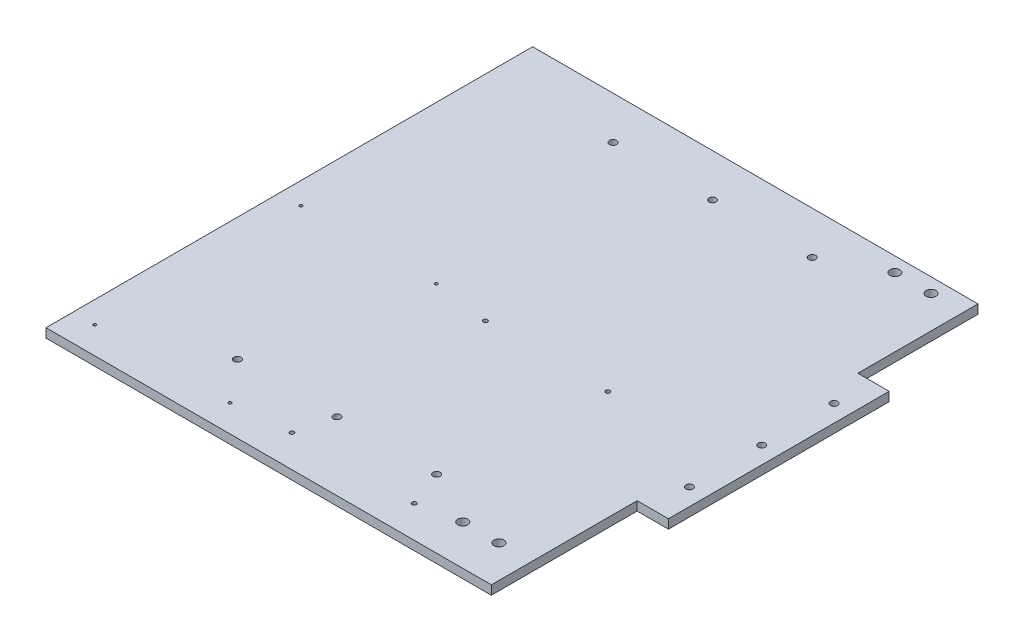
ISO-10303-21;
HEADER;
FILE_DESCRIPTION(('STEP AP214'),'2;1');
FILE_NAME('part.step','',(''),(''),'','','');
FILE_SCHEMA(('AUTOMOTIVE_DESIGN { 1 0 10303 214 1 1 1 1 }'));
ENDSEC;
DATA;
#1=APPLICATION_CONTEXT('core data for automotive mechanical design processes');
#2=APPLICATION_PROTOCOL_DEFINITION('international standard','automotive_design',2000,#1);
#3=PRODUCT_CONTEXT('',#1,'mechanical');
#4=PRODUCT('Part','Part','',(#3));
#5=PRODUCT_RELATED_PRODUCT_CATEGORY('part','',(#4));
#6=PRODUCT_DEFINITION_FORMATION('','',#4);
#7=PRODUCT_DEFINITION_CONTEXT('part definition',#1,'design');
#8=PRODUCT_DEFINITION('design','',#6,#7);
#9=PRODUCT_DEFINITION_SHAPE('','',#8);
#10=(LENGTH_UNIT() NAMED_UNIT(*) SI_UNIT(.MILLI.,.METRE.));
#11=(NAMED_UNIT(*) PLANE_ANGLE_UNIT() SI_UNIT($,.RADIAN.));
#12=(NAMED_UNIT(*) SI_UNIT($,.STERADIAN.) SOLID_ANGLE_UNIT());
#13=UNCERTAINTY_MEASURE_WITH_UNIT(LENGTH_MEASURE(1.E-05),#10,'distance_accuracy_value','');
#14=(GEOMETRIC_REPRESENTATION_CONTEXT(3) GLOBAL_UNCERTAINTY_ASSIGNED_CONTEXT((#13)) GLOBAL_UNIT_ASSIGNED_CONTEXT((#10,
#11,#12)) REPRESENTATION_CONTEXT('',''));
#15=CARTESIAN_POINT('',(0.,0.,0.));
#16=DIRECTION('',(0.,0.,1.));
#17=DIRECTION('',(1.,0.,0.));
#18=AXIS2_PLACEMENT_3D('',#15,#16,#17);
#19=CARTESIAN_POINT('',(156.499999999998,-6.35,171.));
#20=DIRECTION('',(1.,0.,0.));
#21=DIRECTION('',(0.,0.,-1.));
#22=AXIS2_PLACEMENT_3D('',#19,#20,#21);
#23=PLANE('',#22);
#24=DIRECTION('',(0.,0.,-1.));
#25=VECTOR('',#24,1.);
#26=CARTESIAN_POINT('',(156.499999999998,-6.35,171.));
#27=LINE('',#26,#25);
#28=CARTESIAN_POINT('',(156.499999999998,-6.35,171.));
#29=VERTEX_POINT('',#28);
#30=CARTESIAN_POINT('',(156.499999999998,-6.35,68.570201764885));
#31=VERTEX_POINT('',#30);
#32=EDGE_CURVE('E147',#29,#31,#27,.T.);
#33=ORIENTED_EDGE('',*,*,#32,.T.);
#34=DIRECTION('',(0.,1.,0.));
#35=VECTOR('',#34,1.);
#36=CARTESIAN_POINT('',(156.499999999998,-6.35,68.570201764885));
#37=LINE('',#36,#35);
#38=CARTESIAN_POINT('',(156.499999999998,0.,68.570201764885));
#39=VERTEX_POINT('',#38);
#40=EDGE_CURVE('E129',#31,#39,#37,.T.);
#41=ORIENTED_EDGE('',*,*,#40,.T.);
#42=DIRECTION('',(0.,0.,-1.));
#43=VECTOR('',#42,1.);
#44=CARTESIAN_POINT('',(156.499999999998,0.,171.));
#45=LINE('',#44,#43);
#46=CARTESIAN_POINT('',(156.499999999998,0.,171.));
#47=VERTEX_POINT('',#46);
#48=EDGE_CURVE('E157',#47,#39,#45,.T.);
#49=ORIENTED_EDGE('',*,*,#48,.F.);
#50=DIRECTION('',(0.,1.,0.));
#51=VECTOR('',#50,1.);
#52=CARTESIAN_POINT('',(156.499999999998,-6.35,171.));
#53=LINE('',#52,#51);
#54=EDGE_CURVE('E11',#29,#47,#53,.T.);
#55=ORIENTED_EDGE('',*,*,#54,.F.);
#56=EDGE_LOOP('',(#33,#41,#49,#55));
#57=FACE_BOUND('',#56,.T.);
#58=ADVANCED_FACE('F36',(#57),#23,.T.);
#59=DIRECTION('',(0.,1.,0.));
#60=VECTOR('',#59,1.);
#61=CARTESIAN_POINT('',(156.499999999998,-6.35,-86.570201764878));
#62=LINE('',#61,#60);
#63=CARTESIAN_POINT('',(156.499999999998,-6.35,-86.570201764878));
#64=VERTEX_POINT('',#63);
#65=CARTESIAN_POINT('',(156.499999999998,0.,-86.570201764878));
#66=VERTEX_POINT('',#65);
#67=EDGE_CURVE('E144',#64,#66,#62,.T.);
#68=ORIENTED_EDGE('',*,*,#67,.F.);
#69=CARTESIAN_POINT('',(156.499999999998,-6.35,-171.));
#70=VERTEX_POINT('',#69);
#71=EDGE_CURVE('E87',#64,#70,#27,.T.);
#72=ORIENTED_EDGE('',*,*,#71,.T.);
#73=DIRECTION('',(0.,1.,0.));
#74=VECTOR('',#73,1.);
#75=CARTESIAN_POINT('',(156.499999999998,-6.35,-171.));
#76=LINE('',#75,#74);
#77=CARTESIAN_POINT('',(156.499999999998,0.,-171.));
#78=VERTEX_POINT('',#77);
#79=EDGE_CURVE('E40',#70,#78,#76,.T.);
#80=ORIENTED_EDGE('',*,*,#79,.T.);
#81=EDGE_CURVE('E143',#66,#78,#45,.T.);
#82=ORIENTED_EDGE('',*,*,#81,.F.);
#83=EDGE_LOOP('',(#68,#72,#80,#82));
#84=FACE_BOUND('',#83,.T.);
#85=ADVANCED_FACE('F38',(#84),#23,.T.);
#86=CARTESIAN_POINT('',(-156.500000000002,-6.35,171.));
#87=DIRECTION('',(0.,0.,1.));
#88=DIRECTION('',(1.,0.,0.));
#89=AXIS2_PLACEMENT_3D('',#86,#87,#88);
#90=PLANE('',#89);
#91=DIRECTION('',(1.,0.,0.));
#92=VECTOR('',#91,1.);
#93=CARTESIAN_POINT('',(-156.500000000002,0.,171.));
#94=LINE('',#93,#92);
#95=CARTESIAN_POINT('',(-156.500000000002,0.,171.));
#96=VERTEX_POINT('',#95);
#97=EDGE_CURVE('E166',#96,#47,#94,.T.);
#98=ORIENTED_EDGE('',*,*,#97,.F.);
#99=DIRECTION('',(0.,1.,0.));
#100=VECTOR('',#99,1.);
#101=CARTESIAN_POINT('',(-156.500000000002,-6.35,171.));
#102=LINE('',#101,#100);
#103=CARTESIAN_POINT('',(-156.500000000002,-6.35,171.));
#104=VERTEX_POINT('',#103);
#105=EDGE_CURVE('E45',#104,#96,#102,.T.);
#106=ORIENTED_EDGE('',*,*,#105,.F.);
#107=DIRECTION('',(1.,0.,0.));
#108=VECTOR('',#107,1.);
#109=CARTESIAN_POINT('',(-156.500000000002,-6.35,171.));
#110=LINE('',#109,#108);
#111=EDGE_CURVE('E155',#104,#29,#110,.T.);
#112=ORIENTED_EDGE('',*,*,#111,.T.);
#113=ORIENTED_EDGE('',*,*,#54,.T.);
#114=EDGE_LOOP('',(#98,#106,#112,#113));
#115=FACE_BOUND('',#114,.T.);
#116=ADVANCED_FACE('F186',(#115),#90,.T.);
#117=CARTESIAN_POINT('',(-156.500000000002,-6.35,171.));
#118=DIRECTION('',(-1.,0.,0.));
#119=DIRECTION('',(0.,0.,1.));
#120=AXIS2_PLACEMENT_3D('',#117,#118,#119);
#121=PLANE('',#120);
#122=DIRECTION('',(0.,0.,1.));
#123=VECTOR('',#122,1.);
#124=CARTESIAN_POINT('',(-156.500000000002,0.,171.));
#125=LINE('',#124,#123);
#126=CARTESIAN_POINT('',(-156.500000000002,0.,-171.));
#127=VERTEX_POINT('',#126);
#128=EDGE_CURVE('E163',#127,#96,#125,.T.);
#129=ORIENTED_EDGE('',*,*,#128,.F.);
#130=DIRECTION('',(0.,1.,0.));
#131=VECTOR('',#130,1.);
#132=CARTESIAN_POINT('',(-156.500000000002,-6.35,-171.));
#133=LINE('',#132,#131);
#134=CARTESIAN_POINT('',(-156.500000000002,-6.35,-171.));
#135=VERTEX_POINT('',#134);
#136=EDGE_CURVE('E169',#135,#127,#133,.T.);
#137=ORIENTED_EDGE('',*,*,#136,.F.);
#138=DIRECTION('',(0.,0.,1.));
#139=VECTOR('',#138,1.);
#140=CARTESIAN_POINT('',(-156.500000000002,-6.35,171.));
#141=LINE('',#140,#139);
#142=EDGE_CURVE('E152',#135,#104,#141,.T.);
#143=ORIENTED_EDGE('',*,*,#142,.T.);
#144=ORIENTED_EDGE('',*,*,#105,.T.);
#145=EDGE_LOOP('',(#129,#137,#143,#144));
#146=FACE_BOUND('',#145,.T.);
#147=ADVANCED_FACE('F185',(#146),#121,.T.);
#148=CARTESIAN_POINT('',(-156.500000000002,-6.35,-171.));
#149=DIRECTION('',(0.,0.,-1.));
#150=DIRECTION('',(-1.,0.,0.));
#151=AXIS2_PLACEMENT_3D('',#148,#149,#150);
#152=PLANE('',#151);
#153=DIRECTION('',(-1.,0.,0.));
#154=VECTOR('',#153,1.);
#155=CARTESIAN_POINT('',(-156.500000000002,0.,-171.));
#156=LINE('',#155,#154);
#157=EDGE_CURVE('E160',#78,#127,#156,.T.);
#158=ORIENTED_EDGE('',*,*,#157,.F.);
#159=ORIENTED_EDGE('',*,*,#79,.F.);
#160=DIRECTION('',(-1.,0.,0.));
#161=VECTOR('',#160,1.);
#162=CARTESIAN_POINT('',(-156.500000000002,-6.35,-171.));
#163=LINE('',#162,#161);
#164=EDGE_CURVE('E149',#70,#135,#163,.T.);
#165=ORIENTED_EDGE('',*,*,#164,.T.);
#166=ORIENTED_EDGE('',*,*,#136,.T.);
#167=EDGE_LOOP('',(#158,#159,#165,#166));
#168=FACE_BOUND('',#167,.T.);
#169=ADVANCED_FACE('F175',(#168),#152,.T.);
#170=CARTESIAN_POINT('',(0.,-6.35,0.));
#171=DIRECTION('',(0.,-1.,0.));
#172=DIRECTION('',(0.,0.,-1.));
#173=AXIS2_PLACEMENT_3D('',#170,#171,#172);
#174=PLANE('',#173);
#175=CARTESIAN_POINT('',(-46.1138576779062,-6.35000000000026,7.1138576779035));
#176=DIRECTION('',(0.,1.,0.));
#177=DIRECTION('',(0.,0.,1.));
#178=AXIS2_PLACEMENT_3D('',#175,#176,#177);
#179=CIRCLE('',#178,1.05000000000002);
#180=CARTESIAN_POINT('',(-46.1138576779062,-6.35000000000026,8.16385767790351));
#181=VERTEX_POINT('',#180);
#182=EDGE_CURVE('E322',#181,#181,#179,.T.);
#183=ORIENTED_EDGE('',*,*,#182,.T.);
#184=EDGE_LOOP('',(#183));
#185=FACE_BOUND('',#184,.T.);
#186=CARTESIAN_POINT('',(79.7700374531822,-6.35000000000026,12.4704119850208));
#187=DIRECTION('',(0.,1.,0.));
#188=DIRECTION('',(0.,0.,1.));
#189=AXIS2_PLACEMENT_3D('',#186,#187,#188);
#190=CIRCLE('',#189,1.50000000000009);
#191=CARTESIAN_POINT('',(79.7700374531822,-6.35000000000026,13.9704119850209));
#192=VERTEX_POINT('',#191);
#193=EDGE_CURVE('E332',#192,#192,#190,.T.);
#194=ORIENTED_EDGE('',*,*,#193,.T.);
#195=EDGE_LOOP('',(#194));
#196=FACE_BOUND('',#195,.T.);
#197=CARTESIAN_POINT('',(-6.2299625468179,-6.35000000000026,12.4704119850202));
#198=DIRECTION('',(0.,1.,0.));
#199=DIRECTION('',(0.,0.,1.));
#200=AXIS2_PLACEMENT_3D('',#197,#198,#199);
#201=CIRCLE('',#200,1.49999999999985);
#202=CARTESIAN_POINT('',(-6.2299625468179,-6.35000000000026,13.9704119850201));
#203=VERTEX_POINT('',#202);
#204=EDGE_CURVE('E331',#203,#203,#201,.T.);
#205=ORIENTED_EDGE('',*,*,#204,.T.);
#206=EDGE_LOOP('',(#205));
#207=FACE_BOUND('',#206,.T.);
#208=CARTESIAN_POINT('',(-6.22996254681885,-6.35000000000026,148.47041198502));
#209=DIRECTION('',(0.,1.,0.));
#210=DIRECTION('',(0.,0.,1.));
#211=AXIS2_PLACEMENT_3D('',#208,#209,#210);
#212=CIRCLE('',#211,1.49999999999985);
#213=CARTESIAN_POINT('',(-6.22996254681885,-6.35000000000026,149.97041198502));
#214=VERTEX_POINT('',#213);
#215=EDGE_CURVE('E343',#214,#214,#212,.T.);
#216=ORIENTED_EDGE('',*,*,#215,.T.);
#217=EDGE_LOOP('',(#216));
#218=FACE_BOUND('',#217,.T.);
#219=CARTESIAN_POINT('',(-141.113857677907,-6.35000000000026,152.113857677903));
#220=DIRECTION('',(0.,1.,0.));
#221=DIRECTION('',(0.,0.,1.));
#222=AXIS2_PLACEMENT_3D('',#219,#220,#221);
#223=CIRCLE('',#222,1.05000000000003);
#224=CARTESIAN_POINT('',(-141.113857677907,-6.35000000000026,153.163857677903));
#225=VERTEX_POINT('',#224);
#226=EDGE_CURVE('E307',#225,#225,#223,.T.);
#227=ORIENTED_EDGE('',*,*,#226,.T.);
#228=EDGE_LOOP('',(#227));
#229=FACE_BOUND('',#228,.T.);
#230=CARTESIAN_POINT('',(-141.113857677906,-6.35000000000026,7.11385767790317));
#231=DIRECTION('',(0.,1.,0.));
#232=DIRECTION('',(0.,0.,1.));
#233=AXIS2_PLACEMENT_3D('',#230,#231,#232);
#234=CIRCLE('',#233,1.05000000000019);
#235=CARTESIAN_POINT('',(-141.113857677906,-6.35000000000026,8.16385767790336));
#236=VERTEX_POINT('',#235);
#237=EDGE_CURVE('E312',#236,#236,#234,.T.);
#238=ORIENTED_EDGE('',*,*,#237,.T.);
#239=EDGE_LOOP('',(#238));
#240=FACE_BOUND('',#239,.T.);
#241=CARTESIAN_POINT('',(-46.1138576779068,-6.35000000000026,152.113857677903));
#242=DIRECTION('',(0.,1.,0.));
#243=DIRECTION('',(0.,0.,1.));
#244=AXIS2_PLACEMENT_3D('',#241,#242,#243);
#245=CIRCLE('',#244,1.04999999999979);
#246=CARTESIAN_POINT('',(-46.1138576779068,-6.35000000000026,153.163857677903));
#247=VERTEX_POINT('',#246);
#248=EDGE_CURVE('E323',#247,#247,#245,.T.);
#249=ORIENTED_EDGE('',*,*,#248,.T.);
#250=EDGE_LOOP('',(#249));
#251=FACE_BOUND('',#250,.T.);
#252=CARTESIAN_POINT('',(79.7700374531812,-6.35000000000026,148.470411985021));
#253=DIRECTION('',(0.,1.,0.));
#254=DIRECTION('',(0.,0.,1.));
#255=AXIS2_PLACEMENT_3D('',#252,#253,#254);
#256=CIRCLE('',#255,1.50000000000009);
#257=CARTESIAN_POINT('',(79.7700374531812,-6.35000000000026,149.970411985021));
#258=VERTEX_POINT('',#257);
#259=EDGE_CURVE('E351',#258,#258,#256,.T.);
#260=ORIENTED_EDGE('',*,*,#259,.T.);
#261=EDGE_LOOP('',(#260));
#262=FACE_BOUND('',#261,.T.);
#263=CARTESIAN_POINT('',(133.639999999999,-6.35000000000039,-160.839999999994));
#264=DIRECTION('',(0.,-1.,0.));
#265=DIRECTION('',(0.,0.,-1.));
#266=AXIS2_PLACEMENT_3D('',#263,#264,#265);
#267=CIRCLE('',#266,3.49999999999999);
#268=CARTESIAN_POINT('',(133.639999999999,-6.35000000000026,-164.339999999994));
#269=VERTEX_POINT('',#268);
#270=EDGE_CURVE('E357',#269,#269,#267,.T.);
#271=ORIENTED_EDGE('',*,*,#270,.F.);
#272=EDGE_LOOP('',(#271));
#273=FACE_BOUND('',#272,.T.);
#274=CARTESIAN_POINT('',(108.239999999999,-6.35000000000039,-160.839999999994));
#275=DIRECTION('',(0.,-1.,0.));
#276=DIRECTION('',(0.,0.,-1.));
#277=AXIS2_PLACEMENT_3D('',#274,#275,#276);
#278=CIRCLE('',#277,3.50000000000001);
#279=CARTESIAN_POINT('',(108.239999999999,-6.35000000000026,-164.339999999994));
#280=VERTEX_POINT('',#279);
#281=EDGE_CURVE('E364',#280,#280,#278,.T.);
#282=ORIENTED_EDGE('',*,*,#281,.F.);
#283=EDGE_LOOP('',(#282));
#284=FACE_BOUND('',#283,.T.);
#285=CARTESIAN_POINT('',(133.639999999998,-6.35,142.84));
#286=DIRECTION('',(0.,1.,0.));
#287=DIRECTION('',(0.,0.,1.));
#288=AXIS2_PLACEMENT_3D('',#285,#286,#287);
#289=CIRCLE('',#288,3.49999999999999);
#290=CARTESIAN_POINT('',(133.639999999998,-6.35,146.34));
#291=VERTEX_POINT('',#290);
#292=EDGE_CURVE('E369',#291,#291,#289,.T.);
#293=ORIENTED_EDGE('',*,*,#292,.T.);
#294=EDGE_LOOP('',(#293));
#295=FACE_BOUND('',#294,.T.);
#296=CARTESIAN_POINT('',(108.239999999998,-6.35,142.84));
#297=DIRECTION('',(0.,1.,0.));
#298=DIRECTION('',(0.,0.,1.));
#299=AXIS2_PLACEMENT_3D('',#296,#297,#298);
#300=CIRCLE('',#299,3.50000000000001);
#301=CARTESIAN_POINT('',(108.239999999998,-6.35,146.34));
#302=VERTEX_POINT('',#301);
#303=EDGE_CURVE('E360',#302,#302,#300,.T.);
#304=ORIENTED_EDGE('',*,*,#303,.T.);
#305=EDGE_LOOP('',(#304));
#306=FACE_BOUND('',#305,.T.);
#307=CARTESIAN_POINT('',(-70.,-6.35,123.000000000004));
#308=DIRECTION('',(0.,1.,0.));
#309=DIRECTION('',(0.,0.,1.));
#310=AXIS2_PLACEMENT_3D('',#307,#308,#309);
#311=CIRCLE('',#310,2.5);
#312=CARTESIAN_POINT('',(-70.,-6.35,125.500000000004));
#313=VERTEX_POINT('',#312);
#314=EDGE_CURVE('E391',#313,#313,#311,.T.);
#315=ORIENTED_EDGE('',*,*,#314,.T.);
#316=EDGE_LOOP('',(#315));
#317=FACE_BOUND('',#316,.T.);
#318=CARTESIAN_POINT('',(70.,-6.35,123.000000000004));
#319=DIRECTION('',(0.,1.,0.));
#320=DIRECTION('',(0.,0.,-1.));
#321=AXIS2_PLACEMENT_3D('',#318,#319,#320);
#322=CIRCLE('',#321,2.5);
#323=CARTESIAN_POINT('',(70.,-6.35,120.500000000004));
#324=VERTEX_POINT('',#323);
#325=EDGE_CURVE('E397',#324,#324,#322,.T.);
#326=ORIENTED_EDGE('',*,*,#325,.T.);
#327=EDGE_LOOP('',(#326));
#328=FACE_BOUND('',#327,.T.);
#329=CARTESIAN_POINT('',(-70.,-6.35,-140.999999999996));
#330=DIRECTION('',(0.,1.,0.));
#331=DIRECTION('',(0.,0.,-1.));
#332=AXIS2_PLACEMENT_3D('',#329,#330,#331);
#333=CIRCLE('',#332,2.5);
#334=CARTESIAN_POINT('',(-70.,-6.35,-143.499999999996));
#335=VERTEX_POINT('',#334);
#336=EDGE_CURVE('E403',#335,#335,#333,.T.);
#337=ORIENTED_EDGE('',*,*,#336,.T.);
#338=EDGE_LOOP('',(#337));
#339=FACE_BOUND('',#338,.T.);
#340=CARTESIAN_POINT('',(0.,-6.35,-140.999999999996));
#341=DIRECTION('',(0.,1.,0.));
#342=DIRECTION('',(0.,0.,-1.));
#343=AXIS2_PLACEMENT_3D('',#340,#341,#342);
#344=CIRCLE('',#343,2.49999999999999);
#345=CARTESIAN_POINT('',(0.,-6.35,-143.499999999996));
#346=VERTEX_POINT('',#345);
#347=EDGE_CURVE('E384',#346,#346,#344,.T.);
#348=ORIENTED_EDGE('',*,*,#347,.T.);
#349=EDGE_LOOP('',(#348));
#350=FACE_BOUND('',#349,.T.);
#351=CARTESIAN_POINT('',(70.,-6.35,-140.999999999996));
#352=DIRECTION('',(0.,1.,0.));
#353=DIRECTION('',(0.,0.,1.));
#354=AXIS2_PLACEMENT_3D('',#351,#352,#353);
#355=CIRCLE('',#354,2.5);
#356=CARTESIAN_POINT('',(70.,-6.35,-138.499999999996));
#357=VERTEX_POINT('',#356);
#358=EDGE_CURVE('E372',#357,#357,#355,.T.);
#359=ORIENTED_EDGE('',*,*,#358,.T.);
#360=EDGE_LOOP('',(#359));
#361=FACE_BOUND('',#360,.T.);
#362=CARTESIAN_POINT('',(0.,-6.35,123.000000000004));
#363=DIRECTION('',(0.,1.,0.));
#364=DIRECTION('',(0.,0.,1.));
#365=AXIS2_PLACEMENT_3D('',#362,#363,#364);
#366=CIRCLE('',#365,2.5);
#367=CARTESIAN_POINT('',(0.,-6.35,125.500000000004));
#368=VERTEX_POINT('',#367);
#369=EDGE_CURVE('E411',#368,#368,#366,.T.);
#370=ORIENTED_EDGE('',*,*,#369,.T.);
#371=EDGE_LOOP('',(#370));
#372=FACE_BOUND('',#371,.T.);
#373=ORIENTED_EDGE('',*,*,#32,.F.);
#374=ORIENTED_EDGE('',*,*,#111,.F.);
#375=ORIENTED_EDGE('',*,*,#142,.F.);
#376=ORIENTED_EDGE('',*,*,#164,.F.);
#377=ORIENTED_EDGE('',*,*,#71,.F.);
#378=DIRECTION('',(-1.,0.,0.));
#379=VECTOR('',#378,1.);
#380=CARTESIAN_POINT('',(178.499999999998,-6.35,-86.570201764878));
#381=LINE('',#380,#379);
#382=CARTESIAN_POINT('',(178.499999999998,-6.35,-86.570201764878));
#383=VERTEX_POINT('',#382);
#384=EDGE_CURVE('E119',#383,#64,#381,.T.);
#385=ORIENTED_EDGE('',*,*,#384,.F.);
#386=DIRECTION('',(0.,0.,-1.));
#387=VECTOR('',#386,1.);
#388=CARTESIAN_POINT('',(178.499999999998,-6.35,68.570201764885));
#389=LINE('',#388,#387);
#390=CARTESIAN_POINT('',(178.499999999998,-6.35,68.570201764885));
#391=VERTEX_POINT('',#390);
#392=EDGE_CURVE('E114',#391,#383,#389,.T.);
#393=ORIENTED_EDGE('',*,*,#392,.F.);
#394=DIRECTION('',(1.,0.,0.));
#395=VECTOR('',#394,1.);
#396=CARTESIAN_POINT('',(156.499999999998,-6.35,68.570201764885));
#397=LINE('',#396,#395);
#398=EDGE_CURVE('E126',#31,#391,#397,.T.);
#399=ORIENTED_EDGE('',*,*,#398,.F.);
#400=EDGE_LOOP('',(#373,#374,#375,#376,#377,#385,#393,#399));
#401=FACE_BOUND('',#400,.T.);
#402=CARTESIAN_POINT('',(166.499999999998,-6.35,-59.7999999999965));
#403=DIRECTION('',(0.,1.,0.));
#404=DIRECTION('',(0.,0.,-1.));
#405=AXIS2_PLACEMENT_3D('',#402,#403,#404);
#406=CIRCLE('',#405,2.5);
#407=CARTESIAN_POINT('',(166.499999999998,-6.35,-62.2999999999965));
#408=VERTEX_POINT('',#407);
#409=EDGE_CURVE('E417',#408,#408,#406,.T.);
#410=ORIENTED_EDGE('',*,*,#409,.T.);
#411=EDGE_LOOP('',(#410));
#412=FACE_BOUND('',#411,.T.);
#413=CARTESIAN_POINT('',(166.499999999998,-6.35,41.8000000000035));
#414=DIRECTION('',(0.,1.,0.));
#415=DIRECTION('',(0.,0.,1.));
#416=AXIS2_PLACEMENT_3D('',#413,#414,#415);
#417=CIRCLE('',#416,2.5);
#418=CARTESIAN_POINT('',(166.499999999998,-6.35,44.3000000000035));
#419=VERTEX_POINT('',#418);
#420=EDGE_CURVE('E423',#419,#419,#417,.T.);
#421=ORIENTED_EDGE('',*,*,#420,.T.);
#422=EDGE_LOOP('',(#421));
#423=FACE_BOUND('',#422,.T.);
#424=CARTESIAN_POINT('',(166.499999999998,-6.35,-8.99999999999648));
#425=DIRECTION('',(0.,1.,0.));
#426=DIRECTION('',(0.,0.,1.));
#427=AXIS2_PLACEMENT_3D('',#424,#425,#426);
#428=CIRCLE('',#427,2.5);
#429=CARTESIAN_POINT('',(166.499999999998,-6.35,-6.49999999999649));
#430=VERTEX_POINT('',#429);
#431=EDGE_CURVE('E140',#430,#430,#428,.T.);
#432=ORIENTED_EDGE('',*,*,#431,.T.);
#433=EDGE_LOOP('',(#432));
#434=FACE_BOUND('',#433,.T.);
#435=ADVANCED_FACE('F124',(#185,#196,#207,#218,#229,#240,#251,#262,#273,#284,#295,#306,#317,
#328,#339,#350,#361,#372,#401,#412,#423,#434),#174,.T.);
#436=CARTESIAN_POINT('',(0.,0.,0.));
#437=DIRECTION('',(0.,-1.,0.));
#438=DIRECTION('',(0.,0.,-1.));
#439=AXIS2_PLACEMENT_3D('',#436,#437,#438);
#440=PLANE('',#439);
#441=CARTESIAN_POINT('',(-46.1138576779062,0.,7.1138576779035));
#442=DIRECTION('',(0.,1.,0.));
#443=DIRECTION('',(0.,0.,1.));
#444=AXIS2_PLACEMENT_3D('',#441,#442,#443);
#445=CIRCLE('',#444,1.05000000000002);
#446=CARTESIAN_POINT('',(-46.1138576779062,0.,8.16385767790351));
#447=VERTEX_POINT('',#446);
#448=EDGE_CURVE('E335',#447,#447,#445,.T.);
#449=ORIENTED_EDGE('',*,*,#448,.F.);
#450=EDGE_LOOP('',(#449));
#451=FACE_BOUND('',#450,.T.);
#452=CARTESIAN_POINT('',(79.7700374531822,0.,12.4704119850208));
#453=DIRECTION('',(0.,1.,0.));
#454=DIRECTION('',(0.,0.,1.));
#455=AXIS2_PLACEMENT_3D('',#452,#453,#454);
#456=CIRCLE('',#455,1.50000000000009);
#457=CARTESIAN_POINT('',(79.7700374531822,0.,13.9704119850209));
#458=VERTEX_POINT('',#457);
#459=EDGE_CURVE('E328',#458,#458,#456,.T.);
#460=ORIENTED_EDGE('',*,*,#459,.F.);
#461=EDGE_LOOP('',(#460));
#462=FACE_BOUND('',#461,.T.);
#463=CARTESIAN_POINT('',(-6.2299625468179,0.,12.4704119850202));
#464=DIRECTION('',(0.,1.,0.));
#465=DIRECTION('',(0.,0.,1.));
#466=AXIS2_PLACEMENT_3D('',#463,#464,#465);
#467=CIRCLE('',#466,1.49999999999985);
#468=CARTESIAN_POINT('',(-6.2299625468179,0.,13.9704119850201));
#469=VERTEX_POINT('',#468);
#470=EDGE_CURVE('E346',#469,#469,#467,.T.);
#471=ORIENTED_EDGE('',*,*,#470,.F.);
#472=EDGE_LOOP('',(#471));
#473=FACE_BOUND('',#472,.T.);
#474=CARTESIAN_POINT('',(-6.22996254681885,0.,148.47041198502));
#475=DIRECTION('',(0.,1.,0.));
#476=DIRECTION('',(0.,0.,1.));
#477=AXIS2_PLACEMENT_3D('',#474,#475,#476);
#478=CIRCLE('',#477,1.49999999999985);
#479=CARTESIAN_POINT('',(-6.22996254681885,0.,149.97041198502));
#480=VERTEX_POINT('',#479);
#481=EDGE_CURVE('E339',#480,#480,#478,.T.);
#482=ORIENTED_EDGE('',*,*,#481,.F.);
#483=EDGE_LOOP('',(#482));
#484=FACE_BOUND('',#483,.T.);
#485=CARTESIAN_POINT('',(-141.113857677907,0.,152.113857677903));
#486=DIRECTION('',(0.,1.,0.));
#487=DIRECTION('',(0.,0.,1.));
#488=AXIS2_PLACEMENT_3D('',#485,#486,#487);
#489=CIRCLE('',#488,1.05000000000003);
#490=CARTESIAN_POINT('',(-141.113857677907,0.,153.163857677903));
#491=VERTEX_POINT('',#490);
#492=EDGE_CURVE('E310',#491,#491,#489,.T.);
#493=ORIENTED_EDGE('',*,*,#492,.F.);
#494=EDGE_LOOP('',(#493));
#495=FACE_BOUND('',#494,.T.);
#496=CARTESIAN_POINT('',(-141.113857677906,0.,7.11385767790317));
#497=DIRECTION('',(0.,1.,0.));
#498=DIRECTION('',(0.,0.,1.));
#499=AXIS2_PLACEMENT_3D('',#496,#497,#498);
#500=CIRCLE('',#499,1.05000000000019);
#501=CARTESIAN_POINT('',(-141.113857677906,0.,8.16385767790336));
#502=VERTEX_POINT('',#501);
#503=EDGE_CURVE('E315',#502,#502,#500,.T.);
#504=ORIENTED_EDGE('',*,*,#503,.F.);
#505=EDGE_LOOP('',(#504));
#506=FACE_BOUND('',#505,.T.);
#507=CARTESIAN_POINT('',(-46.1138576779068,0.,152.113857677903));
#508=DIRECTION('',(0.,1.,0.));
#509=DIRECTION('',(0.,0.,1.));
#510=AXIS2_PLACEMENT_3D('',#507,#508,#509);
#511=CIRCLE('',#510,1.04999999999979);
#512=CARTESIAN_POINT('',(-46.1138576779068,0.,153.163857677903));
#513=VERTEX_POINT('',#512);
#514=EDGE_CURVE('E319',#513,#513,#511,.T.);
#515=ORIENTED_EDGE('',*,*,#514,.F.);
#516=EDGE_LOOP('',(#515));
#517=FACE_BOUND('',#516,.T.);
#518=CARTESIAN_POINT('',(79.7700374531812,0.,148.470411985021));
#519=DIRECTION('',(0.,1.,0.));
#520=DIRECTION('',(0.,0.,1.));
#521=AXIS2_PLACEMENT_3D('',#518,#519,#520);
#522=CIRCLE('',#521,1.50000000000009);
#523=CARTESIAN_POINT('',(79.7700374531812,0.,149.970411985021));
#524=VERTEX_POINT('',#523);
#525=EDGE_CURVE('E342',#524,#524,#522,.T.);
#526=ORIENTED_EDGE('',*,*,#525,.F.);
#527=EDGE_LOOP('',(#526));
#528=FACE_BOUND('',#527,.T.);
#529=CARTESIAN_POINT('',(133.639999999999,5.83162409271444E-12,-160.839999999993));
#530=DIRECTION('',(0.,-1.,0.));
#531=DIRECTION('',(0.,0.,-1.));
#532=AXIS2_PLACEMENT_3D('',#529,#530,#531);
#533=CIRCLE('',#532,3.49999999999999);
#534=CARTESIAN_POINT('',(133.639999999999,5.96604640781258E-12,-164.339999999993));
#535=VERTEX_POINT('',#534);
#536=EDGE_CURVE('E361',#535,#535,#533,.T.);
#537=ORIENTED_EDGE('',*,*,#536,.T.);
#538=EDGE_LOOP('',(#537));
#539=FACE_BOUND('',#538,.T.);
#540=CARTESIAN_POINT('',(108.239999999999,5.83162409271444E-12,-160.839999999994));
#541=DIRECTION('',(0.,-1.,0.));
#542=DIRECTION('',(0.,0.,-1.));
#543=AXIS2_PLACEMENT_3D('',#540,#541,#542);
#544=CIRCLE('',#543,3.50000000000001);
#545=CARTESIAN_POINT('',(108.239999999999,5.96604640781258E-12,-164.339999999994));
#546=VERTEX_POINT('',#545);
#547=EDGE_CURVE('E354',#546,#546,#544,.T.);
#548=ORIENTED_EDGE('',*,*,#547,.T.);
#549=EDGE_LOOP('',(#548));
#550=FACE_BOUND('',#549,.T.);
#551=CARTESIAN_POINT('',(133.639999999998,0.,142.84));
#552=DIRECTION('',(0.,1.,0.));
#553=DIRECTION('',(0.,0.,1.));
#554=AXIS2_PLACEMENT_3D('',#551,#552,#553);
#555=CIRCLE('',#554,3.49999999999999);
#556=CARTESIAN_POINT('',(133.639999999998,0.,146.34));
#557=VERTEX_POINT('',#556);
#558=EDGE_CURVE('E373',#557,#557,#555,.T.);
#559=ORIENTED_EDGE('',*,*,#558,.F.);
#560=EDGE_LOOP('',(#559));
#561=FACE_BOUND('',#560,.T.);
#562=CARTESIAN_POINT('',(108.239999999998,0.,142.84));
#563=DIRECTION('',(0.,1.,0.));
#564=DIRECTION('',(0.,0.,1.));
#565=AXIS2_PLACEMENT_3D('',#562,#563,#564);
#566=CIRCLE('',#565,3.50000000000001);
#567=CARTESIAN_POINT('',(108.239999999998,0.,146.34));
#568=VERTEX_POINT('',#567);
#569=EDGE_CURVE('E376',#568,#568,#566,.T.);
#570=ORIENTED_EDGE('',*,*,#569,.F.);
#571=EDGE_LOOP('',(#570));
#572=FACE_BOUND('',#571,.T.);
#573=CARTESIAN_POINT('',(-70.,0.,123.000000000004));
#574=DIRECTION('',(0.,1.,0.));
#575=DIRECTION('',(0.,0.,1.));
#576=AXIS2_PLACEMENT_3D('',#573,#574,#575);
#577=CIRCLE('',#576,2.5);
#578=CARTESIAN_POINT('',(-70.,0.,125.500000000004));
#579=VERTEX_POINT('',#578);
#580=EDGE_CURVE('E387',#579,#579,#577,.T.);
#581=ORIENTED_EDGE('',*,*,#580,.F.);
#582=EDGE_LOOP('',(#581));
#583=FACE_BOUND('',#582,.T.);
#584=CARTESIAN_POINT('',(70.,0.,123.000000000004));
#585=DIRECTION('',(0.,1.,0.));
#586=DIRECTION('',(0.,0.,-1.));
#587=AXIS2_PLACEMENT_3D('',#584,#585,#586);
#588=CIRCLE('',#587,2.5);
#589=CARTESIAN_POINT('',(70.,0.,120.500000000004));
#590=VERTEX_POINT('',#589);
#591=EDGE_CURVE('E394',#590,#590,#588,.T.);
#592=ORIENTED_EDGE('',*,*,#591,.F.);
#593=EDGE_LOOP('',(#592));
#594=FACE_BOUND('',#593,.T.);
#595=CARTESIAN_POINT('',(-70.,0.,-140.999999999996));
#596=DIRECTION('',(0.,1.,0.));
#597=DIRECTION('',(0.,0.,-1.));
#598=AXIS2_PLACEMENT_3D('',#595,#596,#597);
#599=CIRCLE('',#598,2.5);
#600=CARTESIAN_POINT('',(-70.,0.,-143.499999999996));
#601=VERTEX_POINT('',#600);
#602=EDGE_CURVE('E400',#601,#601,#599,.T.);
#603=ORIENTED_EDGE('',*,*,#602,.F.);
#604=EDGE_LOOP('',(#603));
#605=FACE_BOUND('',#604,.T.);
#606=CARTESIAN_POINT('',(0.,0.,-140.999999999996));
#607=DIRECTION('',(0.,1.,0.));
#608=DIRECTION('',(0.,0.,-1.));
#609=AXIS2_PLACEMENT_3D('',#606,#607,#608);
#610=CIRCLE('',#609,2.49999999999999);
#611=CARTESIAN_POINT('',(0.,0.,-143.499999999996));
#612=VERTEX_POINT('',#611);
#613=EDGE_CURVE('E406',#612,#612,#610,.T.);
#614=ORIENTED_EDGE('',*,*,#613,.F.);
#615=EDGE_LOOP('',(#614));
#616=FACE_BOUND('',#615,.T.);
#617=CARTESIAN_POINT('',(70.,0.,-140.999999999996));
#618=DIRECTION('',(0.,1.,0.));
#619=DIRECTION('',(0.,0.,1.));
#620=AXIS2_PLACEMENT_3D('',#617,#618,#619);
#621=CIRCLE('',#620,2.5);
#622=CARTESIAN_POINT('',(70.,0.,-138.499999999996));
#623=VERTEX_POINT('',#622);
#624=EDGE_CURVE('E381',#623,#623,#621,.T.);
#625=ORIENTED_EDGE('',*,*,#624,.F.);
#626=EDGE_LOOP('',(#625));
#627=FACE_BOUND('',#626,.T.);
#628=CARTESIAN_POINT('',(0.,0.,123.000000000004));
#629=DIRECTION('',(0.,1.,0.));
#630=DIRECTION('',(0.,0.,1.));
#631=AXIS2_PLACEMENT_3D('',#628,#629,#630);
#632=CIRCLE('',#631,2.5);
#633=CARTESIAN_POINT('',(0.,0.,125.500000000004));
#634=VERTEX_POINT('',#633);
#635=EDGE_CURVE('E390',#634,#634,#632,.T.);
#636=ORIENTED_EDGE('',*,*,#635,.F.);
#637=EDGE_LOOP('',(#636));
#638=FACE_BOUND('',#637,.T.);
#639=ORIENTED_EDGE('',*,*,#48,.T.);
#640=DIRECTION('',(1.,0.,0.));
#641=VECTOR('',#640,1.);
#642=CARTESIAN_POINT('',(156.499999999998,0.,68.570201764885));
#643=LINE('',#642,#641);
#644=CARTESIAN_POINT('',(178.499999999998,0.,68.570201764885));
#645=VERTEX_POINT('',#644);
#646=EDGE_CURVE('E53',#39,#645,#643,.T.);
#647=ORIENTED_EDGE('',*,*,#646,.T.);
#648=DIRECTION('',(0.,0.,-1.));
#649=VECTOR('',#648,1.);
#650=CARTESIAN_POINT('',(178.499999999998,0.,68.570201764885));
#651=LINE('',#650,#649);
#652=CARTESIAN_POINT('',(178.499999999998,0.,-86.570201764878));
#653=VERTEX_POINT('',#652);
#654=EDGE_CURVE('E116',#645,#653,#651,.T.);
#655=ORIENTED_EDGE('',*,*,#654,.T.);
#656=DIRECTION('',(-1.,0.,0.));
#657=VECTOR('',#656,1.);
#658=CARTESIAN_POINT('',(178.499999999998,0.,-86.570201764878));
#659=LINE('',#658,#657);
#660=EDGE_CURVE('E130',#653,#66,#659,.T.);
#661=ORIENTED_EDGE('',*,*,#660,.T.);
#662=ORIENTED_EDGE('',*,*,#81,.T.);
#663=ORIENTED_EDGE('',*,*,#157,.T.);
#664=ORIENTED_EDGE('',*,*,#128,.T.);
#665=ORIENTED_EDGE('',*,*,#97,.T.);
#666=EDGE_LOOP('',(#639,#647,#655,#661,#662,#663,#664,#665));
#667=FACE_BOUND('',#666,.T.);
#668=CARTESIAN_POINT('',(166.499999999998,0.,-59.7999999999965));
#669=DIRECTION('',(0.,1.,0.));
#670=DIRECTION('',(0.,0.,-1.));
#671=AXIS2_PLACEMENT_3D('',#668,#669,#670);
#672=CIRCLE('',#671,2.5);
#673=CARTESIAN_POINT('',(166.499999999998,0.,-62.2999999999965));
#674=VERTEX_POINT('',#673);
#675=EDGE_CURVE('E414',#674,#674,#672,.T.);
#676=ORIENTED_EDGE('',*,*,#675,.F.);
#677=EDGE_LOOP('',(#676));
#678=FACE_BOUND('',#677,.T.);
#679=CARTESIAN_POINT('',(166.499999999998,0.,41.8000000000035));
#680=DIRECTION('',(0.,1.,0.));
#681=DIRECTION('',(0.,0.,1.));
#682=AXIS2_PLACEMENT_3D('',#679,#680,#681);
#683=CIRCLE('',#682,2.5);
#684=CARTESIAN_POINT('',(166.499999999998,0.,44.3000000000035));
#685=VERTEX_POINT('',#684);
#686=EDGE_CURVE('E420',#685,#685,#683,.T.);
#687=ORIENTED_EDGE('',*,*,#686,.F.);
#688=EDGE_LOOP('',(#687));
#689=FACE_BOUND('',#688,.T.);
#690=CARTESIAN_POINT('',(166.499999999998,0.,-8.99999999999648));
#691=DIRECTION('',(0.,1.,0.));
#692=DIRECTION('',(0.,0.,1.));
#693=AXIS2_PLACEMENT_3D('',#690,#691,#692);
#694=CIRCLE('',#693,2.5);
#695=CARTESIAN_POINT('',(166.499999999998,0.,-6.49999999999649));
#696=VERTEX_POINT('',#695);
#697=EDGE_CURVE('E135',#696,#696,#694,.T.);
#698=ORIENTED_EDGE('',*,*,#697,.F.);
#699=EDGE_LOOP('',(#698));
#700=FACE_BOUND('',#699,.T.);
#701=ADVANCED_FACE('F177',(#451,#462,#473,#484,#495,#506,#517,#528,#539,#550,#561,#572,#583,
#594,#605,#616,#627,#638,#667,#678,#689,#700),#440,.F.);
#702=CARTESIAN_POINT('',(156.499999999998,-6.35,68.570201764885));
#703=DIRECTION('',(0.,0.,1.));
#704=DIRECTION('',(1.,0.,0.));
#705=AXIS2_PLACEMENT_3D('',#702,#703,#704);
#706=PLANE('',#705);
#707=ORIENTED_EDGE('',*,*,#646,.F.);
#708=ORIENTED_EDGE('',*,*,#40,.F.);
#709=ORIENTED_EDGE('',*,*,#398,.T.);
#710=DIRECTION('',(0.,1.,0.));
#711=VECTOR('',#710,1.);
#712=CARTESIAN_POINT('',(178.499999999998,-6.35,68.570201764885));
#713=LINE('',#712,#711);
#714=EDGE_CURVE('E111',#391,#645,#713,.T.);
#715=ORIENTED_EDGE('',*,*,#714,.T.);
#716=EDGE_LOOP('',(#707,#708,#709,#715));
#717=FACE_BOUND('',#716,.T.);
#718=ADVANCED_FACE('F128',(#717),#706,.T.);
#719=CARTESIAN_POINT('',(178.499999999998,-6.35,-86.570201764878));
#720=DIRECTION('',(0.,0.,-1.));
#721=DIRECTION('',(-1.,0.,0.));
#722=AXIS2_PLACEMENT_3D('',#719,#720,#721);
#723=PLANE('',#722);
#724=ORIENTED_EDGE('',*,*,#660,.F.);
#725=DIRECTION('',(0.,1.,0.));
#726=VECTOR('',#725,1.);
#727=CARTESIAN_POINT('',(178.499999999998,-6.35,-86.570201764878));
#728=LINE('',#727,#726);
#729=EDGE_CURVE('E118',#383,#653,#728,.T.);
#730=ORIENTED_EDGE('',*,*,#729,.F.);
#731=ORIENTED_EDGE('',*,*,#384,.T.);
#732=ORIENTED_EDGE('',*,*,#67,.T.);
#733=EDGE_LOOP('',(#724,#730,#731,#732));
#734=FACE_BOUND('',#733,.T.);
#735=ADVANCED_FACE('F181',(#734),#723,.T.);
#736=CARTESIAN_POINT('',(178.499999999998,-6.35,68.570201764885));
#737=DIRECTION('',(1.,0.,0.));
#738=DIRECTION('',(0.,0.,-1.));
#739=AXIS2_PLACEMENT_3D('',#736,#737,#738);
#740=PLANE('',#739);
#741=ORIENTED_EDGE('',*,*,#654,.F.);
#742=ORIENTED_EDGE('',*,*,#714,.F.);
#743=ORIENTED_EDGE('',*,*,#392,.T.);
#744=ORIENTED_EDGE('',*,*,#729,.T.);
#745=EDGE_LOOP('',(#741,#742,#743,#744));
#746=FACE_BOUND('',#745,.T.);
#747=ADVANCED_FACE('F113',(#746),#740,.T.);
#748=CARTESIAN_POINT('',(166.499999999998,-6.35,-8.99999999999648));
#749=DIRECTION('',(0.,1.,0.));
#750=DIRECTION('',(0.,0.,1.));
#751=AXIS2_PLACEMENT_3D('',#748,#749,#750);
#752=CYLINDRICAL_SURFACE('',#751,2.5);
#753=ORIENTED_EDGE('',*,*,#431,.F.);
#754=EDGE_LOOP('',(#753));
#755=FACE_BOUND('',#754,.T.);
#756=ORIENTED_EDGE('',*,*,#697,.T.);
#757=EDGE_LOOP('',(#756));
#758=FACE_BOUND('',#757,.T.);
#759=ADVANCED_FACE('F217',(#755,#758),#752,.F.);
#760=CARTESIAN_POINT('',(166.499999999998,-6.35,41.8000000000035));
#761=DIRECTION('',(0.,1.,0.));
#762=DIRECTION('',(0.,0.,1.));
#763=AXIS2_PLACEMENT_3D('',#760,#761,#762);
#764=CYLINDRICAL_SURFACE('',#763,2.5);
#765=ORIENTED_EDGE('',*,*,#420,.F.);
#766=EDGE_LOOP('',(#765));
#767=FACE_BOUND('',#766,.T.);
#768=ORIENTED_EDGE('',*,*,#686,.T.);
#769=EDGE_LOOP('',(#768));
#770=FACE_BOUND('',#769,.T.);
#771=ADVANCED_FACE('F222',(#767,#770),#764,.F.);
#772=CARTESIAN_POINT('',(166.499999999998,-6.35,-59.7999999999965));
#773=DIRECTION('',(0.,1.,0.));
#774=DIRECTION('',(0.,0.,1.));
#775=AXIS2_PLACEMENT_3D('',#772,#773,#774);
#776=CYLINDRICAL_SURFACE('',#775,2.5);
#777=ORIENTED_EDGE('',*,*,#409,.F.);
#778=EDGE_LOOP('',(#777));
#779=FACE_BOUND('',#778,.T.);
#780=ORIENTED_EDGE('',*,*,#675,.T.);
#781=EDGE_LOOP('',(#780));
#782=FACE_BOUND('',#781,.T.);
#783=ADVANCED_FACE('F226',(#779,#782),#776,.F.);
#784=CARTESIAN_POINT('',(0.,-6.35,123.000000000004));
#785=DIRECTION('',(0.,1.,0.));
#786=DIRECTION('',(0.,0.,1.));
#787=AXIS2_PLACEMENT_3D('',#784,#785,#786);
#788=CYLINDRICAL_SURFACE('',#787,2.5);
#789=ORIENTED_EDGE('',*,*,#369,.F.);
#790=EDGE_LOOP('',(#789));
#791=FACE_BOUND('',#790,.T.);
#792=ORIENTED_EDGE('',*,*,#635,.T.);
#793=EDGE_LOOP('',(#792));
#794=FACE_BOUND('',#793,.T.);
#795=ADVANCED_FACE('F230',(#791,#794),#788,.F.);
#796=CARTESIAN_POINT('',(70.,-6.35,-140.999999999996));
#797=DIRECTION('',(0.,1.,0.));
#798=DIRECTION('',(0.,0.,1.));
#799=AXIS2_PLACEMENT_3D('',#796,#797,#798);
#800=CYLINDRICAL_SURFACE('',#799,2.5);
#801=ORIENTED_EDGE('',*,*,#358,.F.);
#802=EDGE_LOOP('',(#801));
#803=FACE_BOUND('',#802,.T.);
#804=ORIENTED_EDGE('',*,*,#624,.T.);
#805=EDGE_LOOP('',(#804));
#806=FACE_BOUND('',#805,.T.);
#807=ADVANCED_FACE('F234',(#803,#806),#800,.F.);
#808=CARTESIAN_POINT('',(0.,-6.35,-140.999999999996));
#809=DIRECTION('',(0.,1.,0.));
#810=DIRECTION('',(0.,0.,1.));
#811=AXIS2_PLACEMENT_3D('',#808,#809,#810);
#812=CYLINDRICAL_SURFACE('',#811,2.49999999999999);
#813=ORIENTED_EDGE('',*,*,#347,.F.);
#814=EDGE_LOOP('',(#813));
#815=FACE_BOUND('',#814,.T.);
#816=ORIENTED_EDGE('',*,*,#613,.T.);
#817=EDGE_LOOP('',(#816));
#818=FACE_BOUND('',#817,.T.);
#819=ADVANCED_FACE('F236',(#815,#818),#812,.F.);
#820=CARTESIAN_POINT('',(-70.,-6.35,-140.999999999996));
#821=DIRECTION('',(0.,1.,0.));
#822=DIRECTION('',(0.,0.,1.));
#823=AXIS2_PLACEMENT_3D('',#820,#821,#822);
#824=CYLINDRICAL_SURFACE('',#823,2.5);
#825=ORIENTED_EDGE('',*,*,#336,.F.);
#826=EDGE_LOOP('',(#825));
#827=FACE_BOUND('',#826,.T.);
#828=ORIENTED_EDGE('',*,*,#602,.T.);
#829=EDGE_LOOP('',(#828));
#830=FACE_BOUND('',#829,.T.);
#831=ADVANCED_FACE('F239',(#827,#830),#824,.F.);
#832=CARTESIAN_POINT('',(70.,-6.35,123.000000000004));
#833=DIRECTION('',(0.,1.,0.));
#834=DIRECTION('',(0.,0.,1.));
#835=AXIS2_PLACEMENT_3D('',#832,#833,#834);
#836=CYLINDRICAL_SURFACE('',#835,2.5);
#837=ORIENTED_EDGE('',*,*,#325,.F.);
#838=EDGE_LOOP('',(#837));
#839=FACE_BOUND('',#838,.T.);
#840=ORIENTED_EDGE('',*,*,#591,.T.);
#841=EDGE_LOOP('',(#840));
#842=FACE_BOUND('',#841,.T.);
#843=ADVANCED_FACE('F243',(#839,#842),#836,.F.);
#844=CARTESIAN_POINT('',(-70.,-6.35,123.000000000004));
#845=DIRECTION('',(0.,1.,0.));
#846=DIRECTION('',(0.,0.,1.));
#847=AXIS2_PLACEMENT_3D('',#844,#845,#846);
#848=CYLINDRICAL_SURFACE('',#847,2.5);
#849=ORIENTED_EDGE('',*,*,#314,.F.);
#850=EDGE_LOOP('',(#849));
#851=FACE_BOUND('',#850,.T.);
#852=ORIENTED_EDGE('',*,*,#580,.T.);
#853=EDGE_LOOP('',(#852));
#854=FACE_BOUND('',#853,.T.);
#855=ADVANCED_FACE('F247',(#851,#854),#848,.F.);
#856=CARTESIAN_POINT('',(108.239999999998,-6.35,142.84));
#857=DIRECTION('',(0.,1.,0.));
#858=DIRECTION('',(0.,0.,1.));
#859=AXIS2_PLACEMENT_3D('',#856,#857,#858);
#860=CYLINDRICAL_SURFACE('',#859,3.50000000000001);
#861=ORIENTED_EDGE('',*,*,#303,.F.);
#862=EDGE_LOOP('',(#861));
#863=FACE_BOUND('',#862,.T.);
#864=ORIENTED_EDGE('',*,*,#569,.T.);
#865=EDGE_LOOP('',(#864));
#866=FACE_BOUND('',#865,.T.);
#867=ADVANCED_FACE('F251',(#863,#866),#860,.F.);
#868=CARTESIAN_POINT('',(133.639999999998,-6.35,142.84));
#869=DIRECTION('',(0.,1.,0.));
#870=DIRECTION('',(0.,0.,1.));
#871=AXIS2_PLACEMENT_3D('',#868,#869,#870);
#872=CYLINDRICAL_SURFACE('',#871,3.49999999999999);
#873=ORIENTED_EDGE('',*,*,#292,.F.);
#874=EDGE_LOOP('',(#873));
#875=FACE_BOUND('',#874,.T.);
#876=ORIENTED_EDGE('',*,*,#558,.T.);
#877=EDGE_LOOP('',(#876));
#878=FACE_BOUND('',#877,.T.);
#879=ADVANCED_FACE('F258',(#875,#878),#872,.F.);
#880=CARTESIAN_POINT('',(108.239999999999,-6.35000000000039,-160.839999999994));
#881=DIRECTION('',(0.,1.,0.));
#882=DIRECTION('',(0.,0.,1.));
#883=AXIS2_PLACEMENT_3D('',#880,#881,#882);
#884=CYLINDRICAL_SURFACE('',#883,3.50000000000001);
#885=ORIENTED_EDGE('',*,*,#281,.T.);
#886=EDGE_LOOP('',(#885));
#887=FACE_BOUND('',#886,.T.);
#888=ORIENTED_EDGE('',*,*,#547,.F.);
#889=EDGE_LOOP('',(#888));
#890=FACE_BOUND('',#889,.T.);
#891=ADVANCED_FACE('F262',(#887,#890),#884,.F.);
#892=CARTESIAN_POINT('',(133.639999999999,-6.35000000000039,-160.839999999994));
#893=DIRECTION('',(0.,1.,0.));
#894=DIRECTION('',(0.,0.,1.));
#895=AXIS2_PLACEMENT_3D('',#892,#893,#894);
#896=CYLINDRICAL_SURFACE('',#895,3.49999999999999);
#897=ORIENTED_EDGE('',*,*,#270,.T.);
#898=EDGE_LOOP('',(#897));
#899=FACE_BOUND('',#898,.T.);
#900=ORIENTED_EDGE('',*,*,#536,.F.);
#901=EDGE_LOOP('',(#900));
#902=FACE_BOUND('',#901,.T.);
#903=ADVANCED_FACE('F266',(#899,#902),#896,.F.);
#904=CARTESIAN_POINT('',(79.7700374531812,-6.35000000000026,148.470411985021));
#905=DIRECTION('',(0.,1.,0.));
#906=DIRECTION('',(0.,0.,1.));
#907=AXIS2_PLACEMENT_3D('',#904,#905,#906);
#908=CYLINDRICAL_SURFACE('',#907,1.50000000000009);
#909=ORIENTED_EDGE('',*,*,#259,.F.);
#910=EDGE_LOOP('',(#909));
#911=FACE_BOUND('',#910,.T.);
#912=ORIENTED_EDGE('',*,*,#525,.T.);
#913=EDGE_LOOP('',(#912));
#914=FACE_BOUND('',#913,.T.);
#915=ADVANCED_FACE('F270',(#911,#914),#908,.F.);
#916=CARTESIAN_POINT('',(-46.1138576779068,-6.35000000000026,152.113857677903));
#917=DIRECTION('',(0.,1.,0.));
#918=DIRECTION('',(0.,0.,1.));
#919=AXIS2_PLACEMENT_3D('',#916,#917,#918);
#920=CYLINDRICAL_SURFACE('',#919,1.04999999999979);
#921=ORIENTED_EDGE('',*,*,#248,.F.);
#922=EDGE_LOOP('',(#921));
#923=FACE_BOUND('',#922,.T.);
#924=ORIENTED_EDGE('',*,*,#514,.T.);
#925=EDGE_LOOP('',(#924));
#926=FACE_BOUND('',#925,.T.);
#927=ADVANCED_FACE('F274',(#923,#926),#920,.F.);
#928=CARTESIAN_POINT('',(-141.113857677906,-6.35000000000026,7.11385767790317));
#929=DIRECTION('',(0.,1.,0.));
#930=DIRECTION('',(0.,0.,1.));
#931=AXIS2_PLACEMENT_3D('',#928,#929,#930);
#932=CYLINDRICAL_SURFACE('',#931,1.05000000000019);
#933=ORIENTED_EDGE('',*,*,#237,.F.);
#934=EDGE_LOOP('',(#933));
#935=FACE_BOUND('',#934,.T.);
#936=ORIENTED_EDGE('',*,*,#503,.T.);
#937=EDGE_LOOP('',(#936));
#938=FACE_BOUND('',#937,.T.);
#939=ADVANCED_FACE('F293',(#935,#938),#932,.F.);
#940=CARTESIAN_POINT('',(-141.113857677907,-6.35000000000026,152.113857677903));
#941=DIRECTION('',(0.,1.,0.));
#942=DIRECTION('',(0.,0.,1.));
#943=AXIS2_PLACEMENT_3D('',#940,#941,#942);
#944=CYLINDRICAL_SURFACE('',#943,1.05000000000003);
#945=ORIENTED_EDGE('',*,*,#226,.F.);
#946=EDGE_LOOP('',(#945));
#947=FACE_BOUND('',#946,.T.);
#948=ORIENTED_EDGE('',*,*,#492,.T.);
#949=EDGE_LOOP('',(#948));
#950=FACE_BOUND('',#949,.T.);
#951=ADVANCED_FACE('F284',(#947,#950),#944,.F.);
#952=CARTESIAN_POINT('',(-6.22996254681885,-6.35000000000026,148.47041198502));
#953=DIRECTION('',(0.,1.,0.));
#954=DIRECTION('',(0.,0.,1.));
#955=AXIS2_PLACEMENT_3D('',#952,#953,#954);
#956=CYLINDRICAL_SURFACE('',#955,1.49999999999985);
#957=ORIENTED_EDGE('',*,*,#215,.F.);
#958=EDGE_LOOP('',(#957));
#959=FACE_BOUND('',#958,.T.);
#960=ORIENTED_EDGE('',*,*,#481,.T.);
#961=EDGE_LOOP('',(#960));
#962=FACE_BOUND('',#961,.T.);
#963=ADVANCED_FACE('F280',(#959,#962),#956,.F.);
#964=CARTESIAN_POINT('',(-6.2299625468179,-6.35000000000026,12.4704119850202));
#965=DIRECTION('',(0.,1.,0.));
#966=DIRECTION('',(0.,0.,1.));
#967=AXIS2_PLACEMENT_3D('',#964,#965,#966);
#968=CYLINDRICAL_SURFACE('',#967,1.49999999999985);
#969=ORIENTED_EDGE('',*,*,#204,.F.);
#970=EDGE_LOOP('',(#969));
#971=FACE_BOUND('',#970,.T.);
#972=ORIENTED_EDGE('',*,*,#470,.T.);
#973=EDGE_LOOP('',(#972));
#974=FACE_BOUND('',#973,.T.);
#975=ADVANCED_FACE('F276',(#971,#974),#968,.F.);
#976=CARTESIAN_POINT('',(79.7700374531822,-6.35000000000026,12.4704119850208));
#977=DIRECTION('',(0.,1.,0.));
#978=DIRECTION('',(0.,0.,1.));
#979=AXIS2_PLACEMENT_3D('',#976,#977,#978);
#980=CYLINDRICAL_SURFACE('',#979,1.50000000000009);
#981=ORIENTED_EDGE('',*,*,#193,.F.);
#982=EDGE_LOOP('',(#981));
#983=FACE_BOUND('',#982,.T.);
#984=ORIENTED_EDGE('',*,*,#459,.T.);
#985=EDGE_LOOP('',(#984));
#986=FACE_BOUND('',#985,.T.);
#987=ADVANCED_FACE('F279',(#983,#986),#980,.F.);
#988=CARTESIAN_POINT('',(-46.1138576779062,-6.35000000000026,7.1138576779035));
#989=DIRECTION('',(0.,1.,0.));
#990=DIRECTION('',(0.,0.,1.));
#991=AXIS2_PLACEMENT_3D('',#988,#989,#990);
#992=CYLINDRICAL_SURFACE('',#991,1.05000000000002);
#993=ORIENTED_EDGE('',*,*,#182,.F.);
#994=EDGE_LOOP('',(#993));
#995=FACE_BOUND('',#994,.T.);
#996=ORIENTED_EDGE('',*,*,#448,.T.);
#997=EDGE_LOOP('',(#996));
#998=FACE_BOUND('',#997,.T.);
#999=ADVANCED_FACE('F286',(#995,#998),#992,.F.);
#1000=CLOSED_SHELL('',(#58,#85,#116,#147,#169,#435,#701,#718,#735,#747,#759,#771,#783,#795,#807,
#819,#831,#843,#855,#867,#879,#891,#903,#915,#927,#939,#951,#963,#975,#987,#999));
#1001=MANIFOLD_SOLID_BREP('B2',#1000);
#1002=ADVANCED_BREP_SHAPE_REPRESENTATION('',(#18,#1001),#14);
#1003=SHAPE_DEFINITION_REPRESENTATION(#9,#1002);
ENDSEC;
END-ISO-10303-21;
